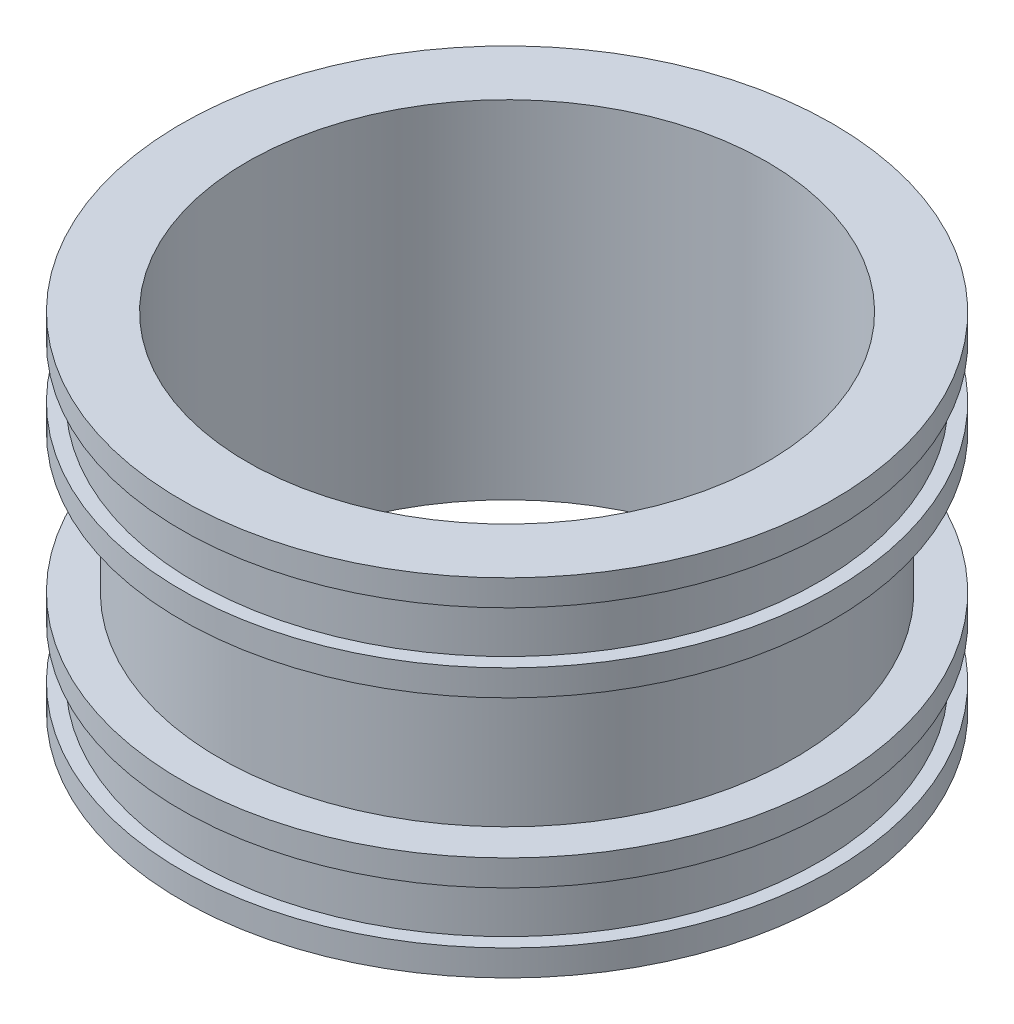
ISO-10303-21;
HEADER;
FILE_DESCRIPTION(('STEP AP214'),'2;1');
FILE_NAME('part.step','',(''),(''),'','','');
FILE_SCHEMA(('AUTOMOTIVE_DESIGN { 1 0 10303 214 1 1 1 1 }'));
ENDSEC;
DATA;
#1=APPLICATION_CONTEXT('core data for automotive mechanical design processes');
#2=APPLICATION_PROTOCOL_DEFINITION('international standard','automotive_design',2000,#1);
#3=PRODUCT_CONTEXT('',#1,'mechanical');
#4=PRODUCT('Part','Part','',(#3));
#5=PRODUCT_RELATED_PRODUCT_CATEGORY('part','',(#4));
#6=PRODUCT_DEFINITION_FORMATION('','',#4);
#7=PRODUCT_DEFINITION_CONTEXT('part definition',#1,'design');
#8=PRODUCT_DEFINITION('design','',#6,#7);
#9=PRODUCT_DEFINITION_SHAPE('','',#8);
#10=(LENGTH_UNIT() NAMED_UNIT(*) SI_UNIT(.MILLI.,.METRE.));
#11=(NAMED_UNIT(*) PLANE_ANGLE_UNIT() SI_UNIT($,.RADIAN.));
#12=(NAMED_UNIT(*) SI_UNIT($,.STERADIAN.) SOLID_ANGLE_UNIT());
#13=UNCERTAINTY_MEASURE_WITH_UNIT(LENGTH_MEASURE(1.E-05),#10,'distance_accuracy_value','');
#14=(GEOMETRIC_REPRESENTATION_CONTEXT(3) GLOBAL_UNCERTAINTY_ASSIGNED_CONTEXT((#13)) GLOBAL_UNIT_ASSIGNED_CONTEXT((#10,
#11,#12)) REPRESENTATION_CONTEXT('',''));
#15=CARTESIAN_POINT('',(0.,0.,0.));
#16=DIRECTION('',(0.,0.,1.));
#17=DIRECTION('',(1.,0.,0.));
#18=AXIS2_PLACEMENT_3D('',#15,#16,#17);
#19=CARTESIAN_POINT('',(0.,0.,0.));
#20=DIRECTION('',(0.,-1.,0.));
#21=DIRECTION('',(0.,0.,-1.));
#22=AXIS2_PLACEMENT_3D('',#19,#20,#21);
#23=CYLINDRICAL_SURFACE('',#22,75.);
#24=CARTESIAN_POINT('',(0.,0.,0.));
#25=DIRECTION('',(0.,-1.,0.));
#26=DIRECTION('',(0.,0.,-1.));
#27=AXIS2_PLACEMENT_3D('',#24,#25,#26);
#28=CIRCLE('',#27,75.);
#29=CARTESIAN_POINT('',(0.,0.,-75.));
#30=VERTEX_POINT('',#29);
#31=EDGE_CURVE('E85',#30,#30,#28,.T.);
#32=ORIENTED_EDGE('',*,*,#31,.T.);
#33=EDGE_LOOP('',(#32));
#34=FACE_BOUND('',#33,.T.);
#35=CARTESIAN_POINT('',(0.,99.9999999999999,0.));
#36=DIRECTION('',(0.,-1.,0.));
#37=DIRECTION('',(0.,0.,-1.));
#38=AXIS2_PLACEMENT_3D('',#35,#36,#37);
#39=CIRCLE('',#38,75.);
#40=CARTESIAN_POINT('',(0.,99.9999999999999,-75.));
#41=VERTEX_POINT('',#40);
#42=EDGE_CURVE('E10',#41,#41,#39,.T.);
#43=ORIENTED_EDGE('',*,*,#42,.F.);
#44=EDGE_LOOP('',(#43));
#45=FACE_BOUND('',#44,.T.);
#46=ADVANCED_FACE('F33',(#34,#45),#23,.F.);
#47=CARTESIAN_POINT('',(75.,99.9999999999998,0.));
#48=DIRECTION('',(0.,1.,0.));
#49=DIRECTION('',(0.,0.,1.));
#50=AXIS2_PLACEMENT_3D('',#47,#48,#49);
#51=PLANE('',#50);
#52=ORIENTED_EDGE('',*,*,#42,.T.);
#53=EDGE_LOOP('',(#52));
#54=FACE_BOUND('',#53,.T.);
#55=CARTESIAN_POINT('',(0.,99.9999999999997,0.));
#56=DIRECTION('',(0.,-1.,0.));
#57=DIRECTION('',(0.,0.,-1.));
#58=AXIS2_PLACEMENT_3D('',#55,#56,#57);
#59=CIRCLE('',#58,94.);
#60=CARTESIAN_POINT('',(0.,99.9999999999997,-94.));
#61=VERTEX_POINT('',#60);
#62=EDGE_CURVE('E39',#61,#61,#59,.T.);
#63=ORIENTED_EDGE('',*,*,#62,.F.);
#64=EDGE_LOOP('',(#63));
#65=FACE_BOUND('',#64,.T.);
#66=ADVANCED_FACE('F103',(#54,#65),#51,.T.);
#67=CARTESIAN_POINT('',(0.,0.,0.));
#68=DIRECTION('',(0.,-1.,0.));
#69=DIRECTION('',(0.,0.,-1.));
#70=AXIS2_PLACEMENT_3D('',#67,#68,#69);
#71=CYLINDRICAL_SURFACE('',#70,94.);
#72=ORIENTED_EDGE('',*,*,#62,.T.);
#73=EDGE_LOOP('',(#72));
#74=FACE_BOUND('',#73,.T.);
#75=CARTESIAN_POINT('',(0.,92.4999999999996,0.));
#76=DIRECTION('',(0.,-1.,0.));
#77=DIRECTION('',(0.,0.,-1.));
#78=AXIS2_PLACEMENT_3D('',#75,#76,#77);
#79=CIRCLE('',#78,94.);
#80=CARTESIAN_POINT('',(0.,92.4999999999996,-94.));
#81=VERTEX_POINT('',#80);
#82=EDGE_CURVE('E43',#81,#81,#79,.T.);
#83=ORIENTED_EDGE('',*,*,#82,.F.);
#84=EDGE_LOOP('',(#83));
#85=FACE_BOUND('',#84,.T.);
#86=ADVANCED_FACE('F107',(#74,#85),#71,.T.);
#87=CARTESIAN_POINT('',(94.,92.4999999999996,0.));
#88=DIRECTION('',(0.,-1.,0.));
#89=DIRECTION('',(0.,0.,-1.));
#90=AXIS2_PLACEMENT_3D('',#87,#88,#89);
#91=PLANE('',#90);
#92=ORIENTED_EDGE('',*,*,#82,.T.);
#93=EDGE_LOOP('',(#92));
#94=FACE_BOUND('',#93,.T.);
#95=CARTESIAN_POINT('',(0.,92.4999999999996,0.));
#96=DIRECTION('',(0.,-1.,0.));
#97=DIRECTION('',(0.,0.,-1.));
#98=AXIS2_PLACEMENT_3D('',#95,#96,#97);
#99=CIRCLE('',#98,90.);
#100=CARTESIAN_POINT('',(0.,92.4999999999996,-90.));
#101=VERTEX_POINT('',#100);
#102=EDGE_CURVE('E47',#101,#101,#99,.T.);
#103=ORIENTED_EDGE('',*,*,#102,.F.);
#104=EDGE_LOOP('',(#103));
#105=FACE_BOUND('',#104,.T.);
#106=ADVANCED_FACE('F111',(#94,#105),#91,.T.);
#107=CARTESIAN_POINT('',(0.,0.,0.));
#108=DIRECTION('',(0.,-1.,0.));
#109=DIRECTION('',(0.,0.,-1.));
#110=AXIS2_PLACEMENT_3D('',#107,#108,#109);
#111=CYLINDRICAL_SURFACE('',#110,90.);
#112=ORIENTED_EDGE('',*,*,#102,.T.);
#113=EDGE_LOOP('',(#112));
#114=FACE_BOUND('',#113,.T.);
#115=CARTESIAN_POINT('',(0.,77.4999999999996,0.));
#116=DIRECTION('',(0.,-1.,0.));
#117=DIRECTION('',(0.,0.,-1.));
#118=AXIS2_PLACEMENT_3D('',#115,#116,#117);
#119=CIRCLE('',#118,90.);
#120=CARTESIAN_POINT('',(0.,77.4999999999996,-90.));
#121=VERTEX_POINT('',#120);
#122=EDGE_CURVE('E52',#121,#121,#119,.T.);
#123=ORIENTED_EDGE('',*,*,#122,.F.);
#124=EDGE_LOOP('',(#123));
#125=FACE_BOUND('',#124,.T.);
#126=ADVANCED_FACE('F117',(#114,#125),#111,.T.);
#127=CARTESIAN_POINT('',(90.,77.4999999999996,0.));
#128=DIRECTION('',(0.,1.,0.));
#129=DIRECTION('',(0.,0.,1.));
#130=AXIS2_PLACEMENT_3D('',#127,#128,#129);
#131=PLANE('',#130);
#132=ORIENTED_EDGE('',*,*,#122,.T.);
#133=EDGE_LOOP('',(#132));
#134=FACE_BOUND('',#133,.T.);
#135=CARTESIAN_POINT('',(0.,77.4999999999996,0.));
#136=DIRECTION('',(0.,-1.,0.));
#137=DIRECTION('',(0.,0.,-1.));
#138=AXIS2_PLACEMENT_3D('',#135,#136,#137);
#139=CIRCLE('',#138,94.);
#140=CARTESIAN_POINT('',(0.,77.4999999999996,-94.));
#141=VERTEX_POINT('',#140);
#142=EDGE_CURVE('E55',#141,#141,#139,.T.);
#143=ORIENTED_EDGE('',*,*,#142,.F.);
#144=EDGE_LOOP('',(#143));
#145=FACE_BOUND('',#144,.T.);
#146=ADVANCED_FACE('F121',(#134,#145),#131,.T.);
#147=CARTESIAN_POINT('',(0.,0.,0.));
#148=DIRECTION('',(0.,-1.,0.));
#149=DIRECTION('',(0.,0.,-1.));
#150=AXIS2_PLACEMENT_3D('',#147,#148,#149);
#151=CYLINDRICAL_SURFACE('',#150,94.);
#152=ORIENTED_EDGE('',*,*,#142,.T.);
#153=EDGE_LOOP('',(#152));
#154=FACE_BOUND('',#153,.T.);
#155=CARTESIAN_POINT('',(0.,69.9999999999996,0.));
#156=DIRECTION('',(0.,-1.,0.));
#157=DIRECTION('',(0.,0.,-1.));
#158=AXIS2_PLACEMENT_3D('',#155,#156,#157);
#159=CIRCLE('',#158,94.);
#160=CARTESIAN_POINT('',(0.,69.9999999999996,-94.));
#161=VERTEX_POINT('',#160);
#162=EDGE_CURVE('E58',#161,#161,#159,.T.);
#163=ORIENTED_EDGE('',*,*,#162,.F.);
#164=EDGE_LOOP('',(#163));
#165=FACE_BOUND('',#164,.T.);
#166=ADVANCED_FACE('F125',(#154,#165),#151,.T.);
#167=CARTESIAN_POINT('',(94.,69.9999999999996,0.));
#168=DIRECTION('',(0.,-1.,0.));
#169=DIRECTION('',(0.,0.,-1.));
#170=AXIS2_PLACEMENT_3D('',#167,#168,#169);
#171=PLANE('',#170);
#172=ORIENTED_EDGE('',*,*,#162,.T.);
#173=EDGE_LOOP('',(#172));
#174=FACE_BOUND('',#173,.T.);
#175=CARTESIAN_POINT('',(0.,69.9999999999995,0.));
#176=DIRECTION('',(0.,-1.,0.));
#177=DIRECTION('',(0.,0.,-1.));
#178=AXIS2_PLACEMENT_3D('',#175,#176,#177);
#179=CIRCLE('',#178,83.);
#180=CARTESIAN_POINT('',(0.,69.9999999999995,-83.));
#181=VERTEX_POINT('',#180);
#182=EDGE_CURVE('E61',#181,#181,#179,.T.);
#183=ORIENTED_EDGE('',*,*,#182,.F.);
#184=EDGE_LOOP('',(#183));
#185=FACE_BOUND('',#184,.T.);
#186=ADVANCED_FACE('F129',(#174,#185),#171,.T.);
#187=CARTESIAN_POINT('',(0.,0.,0.));
#188=DIRECTION('',(0.,-1.,0.));
#189=DIRECTION('',(0.,0.,-1.));
#190=AXIS2_PLACEMENT_3D('',#187,#188,#189);
#191=CYLINDRICAL_SURFACE('',#190,83.);
#192=ORIENTED_EDGE('',*,*,#182,.T.);
#193=EDGE_LOOP('',(#192));
#194=FACE_BOUND('',#193,.T.);
#195=CARTESIAN_POINT('',(0.,30.,0.));
#196=DIRECTION('',(0.,-1.,0.));
#197=DIRECTION('',(0.,0.,-1.));
#198=AXIS2_PLACEMENT_3D('',#195,#196,#197);
#199=CIRCLE('',#198,83.);
#200=CARTESIAN_POINT('',(0.,30.,-83.));
#201=VERTEX_POINT('',#200);
#202=EDGE_CURVE('E64',#201,#201,#199,.T.);
#203=ORIENTED_EDGE('',*,*,#202,.F.);
#204=EDGE_LOOP('',(#203));
#205=FACE_BOUND('',#204,.T.);
#206=ADVANCED_FACE('F133',(#194,#205),#191,.T.);
#207=CARTESIAN_POINT('',(83.,30.,0.));
#208=DIRECTION('',(0.,1.,0.));
#209=DIRECTION('',(0.,0.,1.));
#210=AXIS2_PLACEMENT_3D('',#207,#208,#209);
#211=PLANE('',#210);
#212=ORIENTED_EDGE('',*,*,#202,.T.);
#213=EDGE_LOOP('',(#212));
#214=FACE_BOUND('',#213,.T.);
#215=CARTESIAN_POINT('',(0.,30.0000000000001,0.));
#216=DIRECTION('',(0.,-1.,0.));
#217=DIRECTION('',(0.,0.,-1.));
#218=AXIS2_PLACEMENT_3D('',#215,#216,#217);
#219=CIRCLE('',#218,94.);
#220=CARTESIAN_POINT('',(0.,30.0000000000001,-94.));
#221=VERTEX_POINT('',#220);
#222=EDGE_CURVE('E67',#221,#221,#219,.T.);
#223=ORIENTED_EDGE('',*,*,#222,.F.);
#224=EDGE_LOOP('',(#223));
#225=FACE_BOUND('',#224,.T.);
#226=ADVANCED_FACE('F137',(#214,#225),#211,.T.);
#227=CARTESIAN_POINT('',(0.,0.,0.));
#228=DIRECTION('',(0.,-1.,0.));
#229=DIRECTION('',(0.,0.,-1.));
#230=AXIS2_PLACEMENT_3D('',#227,#228,#229);
#231=CYLINDRICAL_SURFACE('',#230,94.);
#232=ORIENTED_EDGE('',*,*,#222,.T.);
#233=EDGE_LOOP('',(#232));
#234=FACE_BOUND('',#233,.T.);
#235=CARTESIAN_POINT('',(0.,22.5,0.));
#236=DIRECTION('',(0.,-1.,0.));
#237=DIRECTION('',(0.,0.,-1.));
#238=AXIS2_PLACEMENT_3D('',#235,#236,#237);
#239=CIRCLE('',#238,94.);
#240=CARTESIAN_POINT('',(0.,22.5,-94.));
#241=VERTEX_POINT('',#240);
#242=EDGE_CURVE('E70',#241,#241,#239,.T.);
#243=ORIENTED_EDGE('',*,*,#242,.F.);
#244=EDGE_LOOP('',(#243));
#245=FACE_BOUND('',#244,.T.);
#246=ADVANCED_FACE('F141',(#234,#245),#231,.T.);
#247=CARTESIAN_POINT('',(90.,22.5000000000001,0.));
#248=DIRECTION('',(0.,-1.,0.));
#249=DIRECTION('',(0.,0.,-1.));
#250=AXIS2_PLACEMENT_3D('',#247,#248,#249);
#251=PLANE('',#250);
#252=ORIENTED_EDGE('',*,*,#242,.T.);
#253=EDGE_LOOP('',(#252));
#254=FACE_BOUND('',#253,.T.);
#255=CARTESIAN_POINT('',(0.,22.5000000000001,0.));
#256=DIRECTION('',(0.,-1.,0.));
#257=DIRECTION('',(0.,0.,-1.));
#258=AXIS2_PLACEMENT_3D('',#255,#256,#257);
#259=CIRCLE('',#258,90.);
#260=CARTESIAN_POINT('',(0.,22.5000000000001,-90.));
#261=VERTEX_POINT('',#260);
#262=EDGE_CURVE('E73',#261,#261,#259,.T.);
#263=ORIENTED_EDGE('',*,*,#262,.F.);
#264=EDGE_LOOP('',(#263));
#265=FACE_BOUND('',#264,.T.);
#266=ADVANCED_FACE('F145',(#254,#265),#251,.T.);
#267=CARTESIAN_POINT('',(0.,0.,0.));
#268=DIRECTION('',(0.,-1.,0.));
#269=DIRECTION('',(0.,0.,-1.));
#270=AXIS2_PLACEMENT_3D('',#267,#268,#269);
#271=CYLINDRICAL_SURFACE('',#270,90.);
#272=ORIENTED_EDGE('',*,*,#262,.T.);
#273=EDGE_LOOP('',(#272));
#274=FACE_BOUND('',#273,.T.);
#275=CARTESIAN_POINT('',(0.,7.50000000000009,0.));
#276=DIRECTION('',(0.,-1.,0.));
#277=DIRECTION('',(0.,0.,-1.));
#278=AXIS2_PLACEMENT_3D('',#275,#276,#277);
#279=CIRCLE('',#278,90.);
#280=CARTESIAN_POINT('',(0.,7.50000000000009,-90.));
#281=VERTEX_POINT('',#280);
#282=EDGE_CURVE('E76',#281,#281,#279,.T.);
#283=ORIENTED_EDGE('',*,*,#282,.F.);
#284=EDGE_LOOP('',(#283));
#285=FACE_BOUND('',#284,.T.);
#286=ADVANCED_FACE('F149',(#274,#285),#271,.T.);
#287=CARTESIAN_POINT('',(94.,7.50000000000007,0.));
#288=DIRECTION('',(0.,1.,0.));
#289=DIRECTION('',(0.,0.,1.));
#290=AXIS2_PLACEMENT_3D('',#287,#288,#289);
#291=PLANE('',#290);
#292=ORIENTED_EDGE('',*,*,#282,.T.);
#293=EDGE_LOOP('',(#292));
#294=FACE_BOUND('',#293,.T.);
#295=CARTESIAN_POINT('',(0.,7.50000000000006,0.));
#296=DIRECTION('',(0.,-1.,0.));
#297=DIRECTION('',(0.,0.,-1.));
#298=AXIS2_PLACEMENT_3D('',#295,#296,#297);
#299=CIRCLE('',#298,94.);
#300=CARTESIAN_POINT('',(0.,7.50000000000006,-94.));
#301=VERTEX_POINT('',#300);
#302=EDGE_CURVE('E79',#301,#301,#299,.T.);
#303=ORIENTED_EDGE('',*,*,#302,.F.);
#304=EDGE_LOOP('',(#303));
#305=FACE_BOUND('',#304,.T.);
#306=ADVANCED_FACE('F99',(#294,#305),#291,.T.);
#307=CARTESIAN_POINT('',(0.,0.,0.));
#308=DIRECTION('',(0.,-1.,0.));
#309=DIRECTION('',(0.,0.,-1.));
#310=AXIS2_PLACEMENT_3D('',#307,#308,#309);
#311=CYLINDRICAL_SURFACE('',#310,94.);
#312=ORIENTED_EDGE('',*,*,#302,.T.);
#313=EDGE_LOOP('',(#312));
#314=FACE_BOUND('',#313,.T.);
#315=CARTESIAN_POINT('',(0.,0.,0.));
#316=DIRECTION('',(0.,-1.,0.));
#317=DIRECTION('',(0.,0.,-1.));
#318=AXIS2_PLACEMENT_3D('',#315,#316,#317);
#319=CIRCLE('',#318,94.);
#320=CARTESIAN_POINT('',(0.,0.,-94.));
#321=VERTEX_POINT('',#320);
#322=EDGE_CURVE('E82',#321,#321,#319,.T.);
#323=ORIENTED_EDGE('',*,*,#322,.F.);
#324=EDGE_LOOP('',(#323));
#325=FACE_BOUND('',#324,.T.);
#326=ADVANCED_FACE('F93',(#314,#325),#311,.T.);
#327=CARTESIAN_POINT('',(94.,0.,0.));
#328=DIRECTION('',(0.,-1.,0.));
#329=DIRECTION('',(0.,0.,-1.));
#330=AXIS2_PLACEMENT_3D('',#327,#328,#329);
#331=PLANE('',#330);
#332=ORIENTED_EDGE('',*,*,#322,.T.);
#333=EDGE_LOOP('',(#332));
#334=FACE_BOUND('',#333,.T.);
#335=ORIENTED_EDGE('',*,*,#31,.F.);
#336=EDGE_LOOP('',(#335));
#337=FACE_BOUND('',#336,.T.);
#338=ADVANCED_FACE('F91',(#334,#337),#331,.T.);
#339=CLOSED_SHELL('',(#46,#66,#86,#106,#126,#146,#166,#186,#206,#226,#246,#266,#286,#306,#326,#338));
#340=MANIFOLD_SOLID_BREP('B2',#339);
#341=ADVANCED_BREP_SHAPE_REPRESENTATION('',(#18,#340),#14);
#342=SHAPE_DEFINITION_REPRESENTATION(#9,#341);
ENDSEC;
END-ISO-10303-21;
